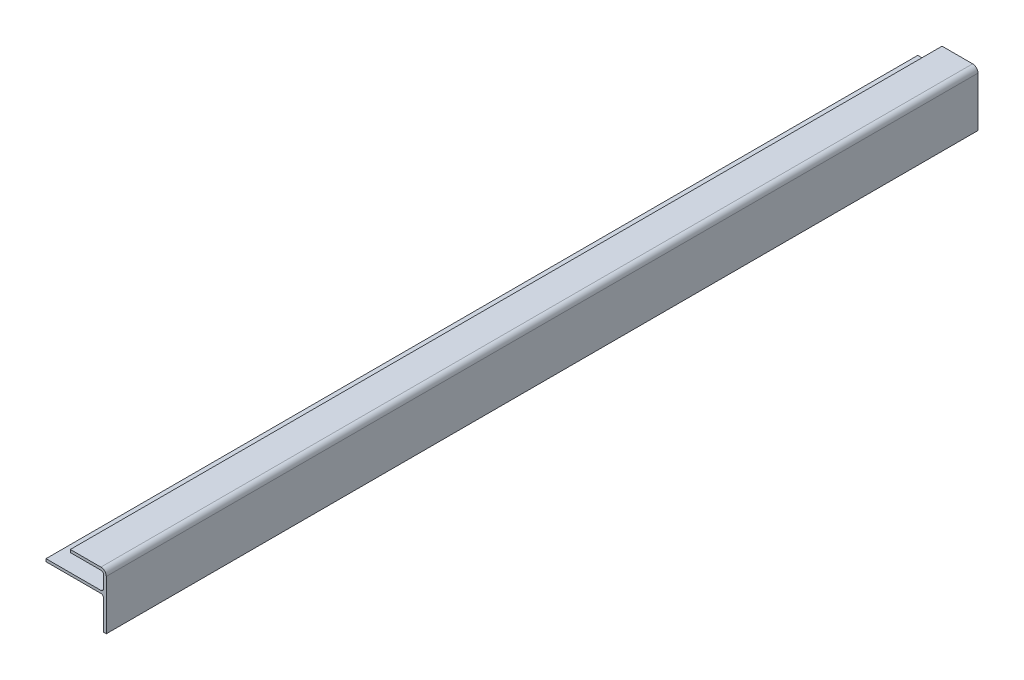
ISO-10303-21;
HEADER;
FILE_DESCRIPTION(('STEP AP214'),'2;1');
FILE_NAME('part.step','',(''),(''),'','','');
FILE_SCHEMA(('AUTOMOTIVE_DESIGN { 1 0 10303 214 1 1 1 1 }'));
ENDSEC;
DATA;
#1=APPLICATION_CONTEXT('core data for automotive mechanical design processes');
#2=APPLICATION_PROTOCOL_DEFINITION('international standard','automotive_design',2000,#1);
#3=PRODUCT_CONTEXT('',#1,'mechanical');
#4=PRODUCT('Part','Part','',(#3));
#5=PRODUCT_RELATED_PRODUCT_CATEGORY('part','',(#4));
#6=PRODUCT_DEFINITION_FORMATION('','',#4);
#7=PRODUCT_DEFINITION_CONTEXT('part definition',#1,'design');
#8=PRODUCT_DEFINITION('design','',#6,#7);
#9=PRODUCT_DEFINITION_SHAPE('','',#8);
#10=(LENGTH_UNIT() NAMED_UNIT(*) SI_UNIT(.MILLI.,.METRE.));
#11=(NAMED_UNIT(*) PLANE_ANGLE_UNIT() SI_UNIT($,.RADIAN.));
#12=(NAMED_UNIT(*) SI_UNIT($,.STERADIAN.) SOLID_ANGLE_UNIT());
#13=UNCERTAINTY_MEASURE_WITH_UNIT(LENGTH_MEASURE(1.E-05),#10,'distance_accuracy_value','');
#14=(GEOMETRIC_REPRESENTATION_CONTEXT(3) GLOBAL_UNCERTAINTY_ASSIGNED_CONTEXT((#13)) GLOBAL_UNIT_ASSIGNED_CONTEXT((#10,
#11,#12)) REPRESENTATION_CONTEXT('',''));
#15=CARTESIAN_POINT('',(0.,0.,0.));
#16=DIRECTION('',(0.,0.,1.));
#17=DIRECTION('',(1.,0.,0.));
#18=AXIS2_PLACEMENT_3D('',#15,#16,#17);
#19=CARTESIAN_POINT('',(1217.6125,36.5125,257.175));
#20=DIRECTION('',(0.,0.,-1.));
#21=DIRECTION('',(-1.,0.,0.));
#22=AXIS2_PLACEMENT_3D('',#19,#20,#21);
#23=CYLINDRICAL_SURFACE('',#22,1.58749999999993);
#24=CARTESIAN_POINT('',(1217.6125,36.5125,-257.175));
#25=DIRECTION('',(0.,0.,-1.));
#26=DIRECTION('',(1.,0.,0.));
#27=AXIS2_PLACEMENT_3D('',#24,#25,#26);
#28=CIRCLE('',#27,1.58749999999993);
#29=CARTESIAN_POINT('',(1217.6125,38.1,-257.175));
#30=VERTEX_POINT('',#29);
#31=CARTESIAN_POINT('',(1219.2,36.5125,-257.175));
#32=VERTEX_POINT('',#31);
#33=EDGE_CURVE('E163',#30,#32,#28,.T.);
#34=ORIENTED_EDGE('',*,*,#33,.T.);
#35=DIRECTION('',(0.,0.,-1.));
#36=VECTOR('',#35,1.);
#37=CARTESIAN_POINT('',(1219.2,36.5125,257.175));
#38=LINE('',#37,#36);
#39=CARTESIAN_POINT('',(1219.2,36.5125,257.175));
#40=VERTEX_POINT('',#39);
#41=EDGE_CURVE('E11',#40,#32,#38,.T.);
#42=ORIENTED_EDGE('',*,*,#41,.F.);
#43=CARTESIAN_POINT('',(1217.6125,36.5125,257.175));
#44=DIRECTION('',(0.,0.,-1.));
#45=DIRECTION('',(1.,0.,0.));
#46=AXIS2_PLACEMENT_3D('',#43,#44,#45);
#47=CIRCLE('',#46,1.58749999999993);
#48=CARTESIAN_POINT('',(1217.6125,38.1,257.175));
#49=VERTEX_POINT('',#48);
#50=EDGE_CURVE('E189',#49,#40,#47,.T.);
#51=ORIENTED_EDGE('',*,*,#50,.F.);
#52=DIRECTION('',(0.,0.,-1.));
#53=VECTOR('',#52,1.);
#54=CARTESIAN_POINT('',(1217.6125,38.1,257.175));
#55=LINE('',#54,#53);
#56=EDGE_CURVE('E159',#49,#30,#55,.T.);
#57=ORIENTED_EDGE('',*,*,#56,.T.);
#58=EDGE_LOOP('',(#34,#42,#51,#57));
#59=FACE_BOUND('',#58,.T.);
#60=ADVANCED_FACE('F31',(#59),#23,.F.);
#61=CARTESIAN_POINT('',(1219.2,19.05,257.175));
#62=DIRECTION('',(1.,0.,0.));
#63=DIRECTION('',(0.,0.,-1.));
#64=AXIS2_PLACEMENT_3D('',#61,#62,#63);
#65=PLANE('',#64);
#66=DIRECTION('',(0.,-1.,0.));
#67=VECTOR('',#66,1.);
#68=CARTESIAN_POINT('',(1219.2,19.05,-257.175));
#69=LINE('',#68,#67);
#70=CARTESIAN_POINT('',(1219.2,19.05,-257.175));
#71=VERTEX_POINT('',#70);
#72=EDGE_CURVE('E166',#32,#71,#69,.T.);
#73=ORIENTED_EDGE('',*,*,#72,.T.);
#74=DIRECTION('',(0.,0.,-1.));
#75=VECTOR('',#74,1.);
#76=CARTESIAN_POINT('',(1219.2,19.05,257.175));
#77=LINE('',#76,#75);
#78=CARTESIAN_POINT('',(1219.2,19.05,257.175));
#79=VERTEX_POINT('',#78);
#80=EDGE_CURVE('E39',#79,#71,#77,.T.);
#81=ORIENTED_EDGE('',*,*,#80,.F.);
#82=DIRECTION('',(0.,-1.,0.));
#83=VECTOR('',#82,1.);
#84=CARTESIAN_POINT('',(1219.2,19.05,257.175));
#85=LINE('',#84,#83);
#86=EDGE_CURVE('E108',#40,#79,#85,.T.);
#87=ORIENTED_EDGE('',*,*,#86,.F.);
#88=ORIENTED_EDGE('',*,*,#41,.T.);
#89=EDGE_LOOP('',(#73,#81,#87,#88));
#90=FACE_BOUND('',#89,.T.);
#91=ADVANCED_FACE('F277',(#90),#65,.F.);
#92=CARTESIAN_POINT('',(1219.2,19.05,257.175));
#93=DIRECTION('',(0.,1.,0.));
#94=DIRECTION('',(0.,0.,1.));
#95=AXIS2_PLACEMENT_3D('',#92,#93,#94);
#96=PLANE('',#95);
#97=DIRECTION('',(1.,0.,0.));
#98=VECTOR('',#97,1.);
#99=CARTESIAN_POINT('',(1219.2,19.05,-257.175));
#100=LINE('',#99,#98);
#101=CARTESIAN_POINT('',(1220.7875,19.05,-257.175));
#102=VERTEX_POINT('',#101);
#103=EDGE_CURVE('E168',#71,#102,#100,.T.);
#104=ORIENTED_EDGE('',*,*,#103,.T.);
#105=DIRECTION('',(0.,0.,-1.));
#106=VECTOR('',#105,1.);
#107=CARTESIAN_POINT('',(1220.7875,19.05,257.175));
#108=LINE('',#107,#106);
#109=CARTESIAN_POINT('',(1220.7875,19.05,257.175));
#110=VERTEX_POINT('',#109);
#111=EDGE_CURVE('E214',#110,#102,#108,.T.);
#112=ORIENTED_EDGE('',*,*,#111,.F.);
#113=DIRECTION('',(1.,0.,0.));
#114=VECTOR('',#113,1.);
#115=CARTESIAN_POINT('',(1219.2,19.05,257.175));
#116=LINE('',#115,#114);
#117=EDGE_CURVE('E222',#79,#110,#116,.T.);
#118=ORIENTED_EDGE('',*,*,#117,.F.);
#119=ORIENTED_EDGE('',*,*,#80,.T.);
#120=EDGE_LOOP('',(#104,#112,#118,#119));
#121=FACE_BOUND('',#120,.T.);
#122=ADVANCED_FACE('F220',(#121),#96,.F.);
#123=CARTESIAN_POINT('',(1220.7875,48.387,257.175));
#124=DIRECTION('',(-1.,0.,0.));
#125=DIRECTION('',(0.,0.,1.));
#126=AXIS2_PLACEMENT_3D('',#123,#124,#125);
#127=PLANE('',#126);
#128=DIRECTION('',(0.,1.,0.));
#129=VECTOR('',#128,1.);
#130=CARTESIAN_POINT('',(1220.7875,48.387,-257.175));
#131=LINE('',#130,#129);
#132=CARTESIAN_POINT('',(1220.7875,48.387,-257.175));
#133=VERTEX_POINT('',#132);
#134=EDGE_CURVE('E170',#102,#133,#131,.T.);
#135=ORIENTED_EDGE('',*,*,#134,.T.);
#136=DIRECTION('',(0.,0.,-1.));
#137=VECTOR('',#136,1.);
#138=CARTESIAN_POINT('',(1220.7875,48.387,257.175));
#139=LINE('',#138,#137);
#140=CARTESIAN_POINT('',(1220.7875,48.387,257.175));
#141=VERTEX_POINT('',#140);
#142=EDGE_CURVE('E211',#141,#133,#139,.T.);
#143=ORIENTED_EDGE('',*,*,#142,.F.);
#144=DIRECTION('',(0.,1.,0.));
#145=VECTOR('',#144,1.);
#146=CARTESIAN_POINT('',(1220.7875,48.387,257.175));
#147=LINE('',#146,#145);
#148=EDGE_CURVE('E240',#110,#141,#147,.T.);
#149=ORIENTED_EDGE('',*,*,#148,.F.);
#150=ORIENTED_EDGE('',*,*,#111,.T.);
#151=EDGE_LOOP('',(#135,#143,#149,#150));
#152=FACE_BOUND('',#151,.T.);
#153=ADVANCED_FACE('F231',(#152),#127,.F.);
#154=CARTESIAN_POINT('',(1217.6125,48.387,257.175));
#155=DIRECTION('',(0.,0.,-1.));
#156=DIRECTION('',(-1.,0.,0.));
#157=AXIS2_PLACEMENT_3D('',#154,#155,#156);
#158=CYLINDRICAL_SURFACE('',#157,3.17499999999997);
#159=CARTESIAN_POINT('',(1217.6125,48.387,-257.175));
#160=DIRECTION('',(0.,0.,1.));
#161=DIRECTION('',(1.,0.,0.));
#162=AXIS2_PLACEMENT_3D('',#159,#160,#161);
#163=CIRCLE('',#162,3.17499999999997);
#164=CARTESIAN_POINT('',(1217.6125,51.562,-257.175));
#165=VERTEX_POINT('',#164);
#166=EDGE_CURVE('E172',#133,#165,#163,.T.);
#167=ORIENTED_EDGE('',*,*,#166,.T.);
#168=DIRECTION('',(0.,0.,-1.));
#169=VECTOR('',#168,1.);
#170=CARTESIAN_POINT('',(1217.6125,51.562,257.175));
#171=LINE('',#170,#169);
#172=CARTESIAN_POINT('',(1217.6125,51.562,257.175));
#173=VERTEX_POINT('',#172);
#174=EDGE_CURVE('E208',#173,#165,#171,.T.);
#175=ORIENTED_EDGE('',*,*,#174,.F.);
#176=CARTESIAN_POINT('',(1217.6125,48.387,257.175));
#177=DIRECTION('',(0.,0.,1.));
#178=DIRECTION('',(1.,0.,0.));
#179=AXIS2_PLACEMENT_3D('',#176,#177,#178);
#180=CIRCLE('',#179,3.17499999999997);
#181=EDGE_CURVE('E237',#141,#173,#180,.T.);
#182=ORIENTED_EDGE('',*,*,#181,.F.);
#183=ORIENTED_EDGE('',*,*,#142,.T.);
#184=EDGE_LOOP('',(#167,#175,#182,#183));
#185=FACE_BOUND('',#184,.T.);
#186=ADVANCED_FACE('F235',(#185),#158,.T.);
#187=CARTESIAN_POINT('',(1217.6125,51.562,257.175));
#188=DIRECTION('',(0.,-1.,0.));
#189=DIRECTION('',(1.,0.,0.));
#190=AXIS2_PLACEMENT_3D('',#187,#188,#189);
#191=PLANE('',#190);
#192=DIRECTION('',(-1.,0.,0.));
#193=VECTOR('',#192,1.);
#194=CARTESIAN_POINT('',(1217.6125,51.562,-257.175));
#195=LINE('',#194,#193);
#196=CARTESIAN_POINT('',(1199.5785,51.562,-257.175));
#197=VERTEX_POINT('',#196);
#198=EDGE_CURVE('E174',#165,#197,#195,.T.);
#199=ORIENTED_EDGE('',*,*,#198,.T.);
#200=DIRECTION('',(0.,0.,-1.));
#201=VECTOR('',#200,1.);
#202=CARTESIAN_POINT('',(1199.5785,51.562,257.175));
#203=LINE('',#202,#201);
#204=CARTESIAN_POINT('',(1199.5785,51.562,257.175));
#205=VERTEX_POINT('',#204);
#206=EDGE_CURVE('E205',#205,#197,#203,.T.);
#207=ORIENTED_EDGE('',*,*,#206,.F.);
#208=DIRECTION('',(-1.,0.,0.));
#209=VECTOR('',#208,1.);
#210=CARTESIAN_POINT('',(1217.6125,51.562,257.175));
#211=LINE('',#210,#209);
#212=EDGE_CURVE('E239',#173,#205,#211,.T.);
#213=ORIENTED_EDGE('',*,*,#212,.F.);
#214=ORIENTED_EDGE('',*,*,#174,.T.);
#215=EDGE_LOOP('',(#199,#207,#213,#214));
#216=FACE_BOUND('',#215,.T.);
#217=ADVANCED_FACE('F290',(#216),#191,.F.);
#218=CARTESIAN_POINT('',(1199.5785,51.562,257.175));
#219=DIRECTION('',(1.,0.,0.));
#220=DIRECTION('',(0.,0.,-1.));
#221=AXIS2_PLACEMENT_3D('',#218,#219,#220);
#222=PLANE('',#221);
#223=DIRECTION('',(0.,-1.,0.));
#224=VECTOR('',#223,1.);
#225=CARTESIAN_POINT('',(1199.5785,51.562,-257.175));
#226=LINE('',#225,#224);
#227=CARTESIAN_POINT('',(1199.5785,49.9745,-257.175));
#228=VERTEX_POINT('',#227);
#229=EDGE_CURVE('E176',#197,#228,#226,.T.);
#230=ORIENTED_EDGE('',*,*,#229,.T.);
#231=DIRECTION('',(0.,0.,-1.));
#232=VECTOR('',#231,1.);
#233=CARTESIAN_POINT('',(1199.5785,49.9745,257.175));
#234=LINE('',#233,#232);
#235=CARTESIAN_POINT('',(1199.5785,49.9745,257.175));
#236=VERTEX_POINT('',#235);
#237=EDGE_CURVE('E202',#236,#228,#234,.T.);
#238=ORIENTED_EDGE('',*,*,#237,.F.);
#239=DIRECTION('',(0.,-1.,0.));
#240=VECTOR('',#239,1.);
#241=CARTESIAN_POINT('',(1199.5785,51.562,257.175));
#242=LINE('',#241,#240);
#243=EDGE_CURVE('E242',#205,#236,#242,.T.);
#244=ORIENTED_EDGE('',*,*,#243,.F.);
#245=ORIENTED_EDGE('',*,*,#206,.T.);
#246=EDGE_LOOP('',(#230,#238,#244,#245));
#247=FACE_BOUND('',#246,.T.);
#248=ADVANCED_FACE('F293',(#247),#222,.F.);
#249=CARTESIAN_POINT('',(1199.5785,49.9745,257.175));
#250=DIRECTION('',(0.,1.,0.));
#251=DIRECTION('',(0.,0.,1.));
#252=AXIS2_PLACEMENT_3D('',#249,#250,#251);
#253=PLANE('',#252);
#254=DIRECTION('',(1.,0.,0.));
#255=VECTOR('',#254,1.);
#256=CARTESIAN_POINT('',(1199.5785,49.9745,-257.175));
#257=LINE('',#256,#255);
#258=CARTESIAN_POINT('',(1217.6125,49.9745,-257.175));
#259=VERTEX_POINT('',#258);
#260=EDGE_CURVE('E178',#228,#259,#257,.T.);
#261=ORIENTED_EDGE('',*,*,#260,.T.);
#262=DIRECTION('',(0.,0.,-1.));
#263=VECTOR('',#262,1.);
#264=CARTESIAN_POINT('',(1217.6125,49.9745,257.175));
#265=LINE('',#264,#263);
#266=CARTESIAN_POINT('',(1217.6125,49.9745,257.175));
#267=VERTEX_POINT('',#266);
#268=EDGE_CURVE('E199',#267,#259,#265,.T.);
#269=ORIENTED_EDGE('',*,*,#268,.F.);
#270=DIRECTION('',(1.,0.,0.));
#271=VECTOR('',#270,1.);
#272=CARTESIAN_POINT('',(1199.5785,49.9745,257.175));
#273=LINE('',#272,#271);
#274=EDGE_CURVE('E248',#236,#267,#273,.T.);
#275=ORIENTED_EDGE('',*,*,#274,.F.);
#276=ORIENTED_EDGE('',*,*,#237,.T.);
#277=EDGE_LOOP('',(#261,#269,#275,#276));
#278=FACE_BOUND('',#277,.T.);
#279=ADVANCED_FACE('F297',(#278),#253,.F.);
#280=CARTESIAN_POINT('',(1217.6125,48.387,257.175));
#281=DIRECTION('',(0.,0.,-1.));
#282=DIRECTION('',(-1.,0.,0.));
#283=AXIS2_PLACEMENT_3D('',#280,#281,#282);
#284=CYLINDRICAL_SURFACE('',#283,1.58749999999993);
#285=CARTESIAN_POINT('',(1217.6125,48.387,-257.175));
#286=DIRECTION('',(0.,0.,-1.));
#287=DIRECTION('',(1.,0.,0.));
#288=AXIS2_PLACEMENT_3D('',#285,#286,#287);
#289=CIRCLE('',#288,1.58749999999993);
#290=CARTESIAN_POINT('',(1219.2,48.387,-257.175));
#291=VERTEX_POINT('',#290);
#292=EDGE_CURVE('E180',#259,#291,#289,.T.);
#293=ORIENTED_EDGE('',*,*,#292,.T.);
#294=DIRECTION('',(0.,0.,-1.));
#295=VECTOR('',#294,1.);
#296=CARTESIAN_POINT('',(1219.2,48.387,257.175));
#297=LINE('',#296,#295);
#298=CARTESIAN_POINT('',(1219.2,48.387,257.175));
#299=VERTEX_POINT('',#298);
#300=EDGE_CURVE('E196',#299,#291,#297,.T.);
#301=ORIENTED_EDGE('',*,*,#300,.F.);
#302=CARTESIAN_POINT('',(1217.6125,48.387,257.175));
#303=DIRECTION('',(0.,0.,-1.));
#304=DIRECTION('',(1.,0.,0.));
#305=AXIS2_PLACEMENT_3D('',#302,#303,#304);
#306=CIRCLE('',#305,1.58749999999993);
#307=EDGE_CURVE('E250',#267,#299,#306,.T.);
#308=ORIENTED_EDGE('',*,*,#307,.F.);
#309=ORIENTED_EDGE('',*,*,#268,.T.);
#310=EDGE_LOOP('',(#293,#301,#308,#309));
#311=FACE_BOUND('',#310,.T.);
#312=ADVANCED_FACE('F301',(#311),#284,.F.);
#313=CARTESIAN_POINT('',(1219.2,48.387,257.175));
#314=DIRECTION('',(1.,0.,0.));
#315=DIRECTION('',(0.,0.,-1.));
#316=AXIS2_PLACEMENT_3D('',#313,#314,#315);
#317=PLANE('',#316);
#318=DIRECTION('',(0.,-1.,0.));
#319=VECTOR('',#318,1.);
#320=CARTESIAN_POINT('',(1219.2,48.387,-257.175));
#321=LINE('',#320,#319);
#322=CARTESIAN_POINT('',(1219.2,41.275,-257.175));
#323=VERTEX_POINT('',#322);
#324=EDGE_CURVE('E182',#291,#323,#321,.T.);
#325=ORIENTED_EDGE('',*,*,#324,.T.);
#326=DIRECTION('',(0.,0.,-1.));
#327=VECTOR('',#326,1.);
#328=CARTESIAN_POINT('',(1219.2,41.275,257.175));
#329=LINE('',#328,#327);
#330=CARTESIAN_POINT('',(1219.2,41.275,257.175));
#331=VERTEX_POINT('',#330);
#332=EDGE_CURVE('E193',#331,#323,#329,.T.);
#333=ORIENTED_EDGE('',*,*,#332,.F.);
#334=DIRECTION('',(0.,-1.,0.));
#335=VECTOR('',#334,1.);
#336=CARTESIAN_POINT('',(1219.2,48.387,257.175));
#337=LINE('',#336,#335);
#338=EDGE_CURVE('E252',#299,#331,#337,.T.);
#339=ORIENTED_EDGE('',*,*,#338,.F.);
#340=ORIENTED_EDGE('',*,*,#300,.T.);
#341=EDGE_LOOP('',(#325,#333,#339,#340));
#342=FACE_BOUND('',#341,.T.);
#343=ADVANCED_FACE('F258',(#342),#317,.F.);
#344=CARTESIAN_POINT('',(1217.6125,41.275,257.175));
#345=DIRECTION('',(0.,0.,-1.));
#346=DIRECTION('',(-1.,0.,0.));
#347=AXIS2_PLACEMENT_3D('',#344,#345,#346);
#348=CYLINDRICAL_SURFACE('',#347,1.58749999999993);
#349=CARTESIAN_POINT('',(1217.6125,41.275,-257.175));
#350=DIRECTION('',(0.,0.,-1.));
#351=DIRECTION('',(1.,0.,0.));
#352=AXIS2_PLACEMENT_3D('',#349,#350,#351);
#353=CIRCLE('',#352,1.58749999999993);
#354=CARTESIAN_POINT('',(1217.6125,39.6875000000001,-257.175));
#355=VERTEX_POINT('',#354);
#356=EDGE_CURVE('E184',#323,#355,#353,.T.);
#357=ORIENTED_EDGE('',*,*,#356,.T.);
#358=DIRECTION('',(0.,0.,-1.));
#359=VECTOR('',#358,1.);
#360=CARTESIAN_POINT('',(1217.6125,39.6875000000001,257.175));
#361=LINE('',#360,#359);
#362=CARTESIAN_POINT('',(1217.6125,39.6875000000001,257.175));
#363=VERTEX_POINT('',#362);
#364=EDGE_CURVE('E154',#363,#355,#361,.T.);
#365=ORIENTED_EDGE('',*,*,#364,.F.);
#366=CARTESIAN_POINT('',(1217.6125,41.275,257.175));
#367=DIRECTION('',(0.,0.,-1.));
#368=DIRECTION('',(1.,0.,0.));
#369=AXIS2_PLACEMENT_3D('',#366,#367,#368);
#370=CIRCLE('',#369,1.58749999999993);
#371=EDGE_CURVE('E145',#331,#363,#370,.T.);
#372=ORIENTED_EDGE('',*,*,#371,.F.);
#373=ORIENTED_EDGE('',*,*,#332,.T.);
#374=EDGE_LOOP('',(#357,#365,#372,#373));
#375=FACE_BOUND('',#374,.T.);
#376=ADVANCED_FACE('F262',(#375),#348,.F.);
#377=CARTESIAN_POINT('',(1185.2275,39.6875,257.175));
#378=DIRECTION('',(0.,-1.,0.));
#379=DIRECTION('',(0.,0.,-1.));
#380=AXIS2_PLACEMENT_3D('',#377,#378,#379);
#381=PLANE('',#380);
#382=DIRECTION('',(-1.,0.,0.));
#383=VECTOR('',#382,1.);
#384=CARTESIAN_POINT('',(1185.2275,39.6875,-257.175));
#385=LINE('',#384,#383);
#386=CARTESIAN_POINT('',(1185.2275,39.6875,-257.175));
#387=VERTEX_POINT('',#386);
#388=EDGE_CURVE('E153',#355,#387,#385,.T.);
#389=ORIENTED_EDGE('',*,*,#388,.T.);
#390=DIRECTION('',(0.,0.,-1.));
#391=VECTOR('',#390,1.);
#392=CARTESIAN_POINT('',(1185.2275,39.6875,257.175));
#393=LINE('',#392,#391);
#394=CARTESIAN_POINT('',(1185.2275,39.6875,257.175));
#395=VERTEX_POINT('',#394);
#396=EDGE_CURVE('E150',#395,#387,#393,.T.);
#397=ORIENTED_EDGE('',*,*,#396,.F.);
#398=DIRECTION('',(-1.,0.,0.));
#399=VECTOR('',#398,1.);
#400=CARTESIAN_POINT('',(1185.2275,39.6875,257.175));
#401=LINE('',#400,#399);
#402=EDGE_CURVE('E139',#363,#395,#401,.T.);
#403=ORIENTED_EDGE('',*,*,#402,.F.);
#404=ORIENTED_EDGE('',*,*,#364,.T.);
#405=EDGE_LOOP('',(#389,#397,#403,#404));
#406=FACE_BOUND('',#405,.T.);
#407=ADVANCED_FACE('F151',(#406),#381,.F.);
#408=CARTESIAN_POINT('',(1185.2275,38.1,257.175));
#409=DIRECTION('',(1.,0.,0.));
#410=DIRECTION('',(0.,0.,-1.));
#411=AXIS2_PLACEMENT_3D('',#408,#409,#410);
#412=PLANE('',#411);
#413=DIRECTION('',(0.,-1.,0.));
#414=VECTOR('',#413,1.);
#415=CARTESIAN_POINT('',(1185.2275,38.1,-257.175));
#416=LINE('',#415,#414);
#417=CARTESIAN_POINT('',(1185.2275,38.1,-257.175));
#418=VERTEX_POINT('',#417);
#419=EDGE_CURVE('E94',#387,#418,#416,.T.);
#420=ORIENTED_EDGE('',*,*,#419,.T.);
#421=DIRECTION('',(0.,0.,-1.));
#422=VECTOR('',#421,1.);
#423=CARTESIAN_POINT('',(1185.2275,38.1,257.175));
#424=LINE('',#423,#422);
#425=CARTESIAN_POINT('',(1185.2275,38.1,257.175));
#426=VERTEX_POINT('',#425);
#427=EDGE_CURVE('E155',#426,#418,#424,.T.);
#428=ORIENTED_EDGE('',*,*,#427,.F.);
#429=DIRECTION('',(0.,-1.,0.));
#430=VECTOR('',#429,1.);
#431=CARTESIAN_POINT('',(1185.2275,38.1,257.175));
#432=LINE('',#431,#430);
#433=EDGE_CURVE('E143',#395,#426,#432,.T.);
#434=ORIENTED_EDGE('',*,*,#433,.F.);
#435=ORIENTED_EDGE('',*,*,#396,.T.);
#436=EDGE_LOOP('',(#420,#428,#434,#435));
#437=FACE_BOUND('',#436,.T.);
#438=ADVANCED_FACE('F157',(#437),#412,.F.);
#439=CARTESIAN_POINT('',(1217.6125,38.1,257.175));
#440=DIRECTION('',(0.,1.,0.));
#441=DIRECTION('',(0.,0.,1.));
#442=AXIS2_PLACEMENT_3D('',#439,#440,#441);
#443=PLANE('',#442);
#444=DIRECTION('',(1.,0.,0.));
#445=VECTOR('',#444,1.);
#446=CARTESIAN_POINT('',(1217.6125,38.1,-257.175));
#447=LINE('',#446,#445);
#448=EDGE_CURVE('E100',#418,#30,#447,.T.);
#449=ORIENTED_EDGE('',*,*,#448,.T.);
#450=ORIENTED_EDGE('',*,*,#56,.F.);
#451=DIRECTION('',(1.,0.,0.));
#452=VECTOR('',#451,1.);
#453=CARTESIAN_POINT('',(1217.6125,38.1,257.175));
#454=LINE('',#453,#452);
#455=EDGE_CURVE('E47',#426,#49,#454,.T.);
#456=ORIENTED_EDGE('',*,*,#455,.F.);
#457=ORIENTED_EDGE('',*,*,#427,.T.);
#458=EDGE_LOOP('',(#449,#450,#456,#457));
#459=FACE_BOUND('',#458,.T.);
#460=ADVANCED_FACE('F266',(#459),#443,.F.);
#461=CARTESIAN_POINT('',(1217.6125,36.5125,257.175));
#462=DIRECTION('',(0.,0.,1.));
#463=DIRECTION('',(1.,0.,0.));
#464=AXIS2_PLACEMENT_3D('',#461,#462,#463);
#465=PLANE('',#464);
#466=ORIENTED_EDGE('',*,*,#50,.T.);
#467=ORIENTED_EDGE('',*,*,#86,.T.);
#468=ORIENTED_EDGE('',*,*,#117,.T.);
#469=ORIENTED_EDGE('',*,*,#148,.T.);
#470=ORIENTED_EDGE('',*,*,#181,.T.);
#471=ORIENTED_EDGE('',*,*,#212,.T.);
#472=ORIENTED_EDGE('',*,*,#243,.T.);
#473=ORIENTED_EDGE('',*,*,#274,.T.);
#474=ORIENTED_EDGE('',*,*,#307,.T.);
#475=ORIENTED_EDGE('',*,*,#338,.T.);
#476=ORIENTED_EDGE('',*,*,#371,.T.);
#477=ORIENTED_EDGE('',*,*,#402,.T.);
#478=ORIENTED_EDGE('',*,*,#433,.T.);
#479=ORIENTED_EDGE('',*,*,#455,.T.);
#480=EDGE_LOOP('',(#466,#467,#468,#469,#470,#471,#472,#473,#474,#475,#476,#477,#478,#479));
#481=FACE_BOUND('',#480,.T.);
#482=ADVANCED_FACE('F141',(#481),#465,.T.);
#483=CARTESIAN_POINT('',(1217.6125,36.5125,-257.175));
#484=DIRECTION('',(0.,0.,1.));
#485=DIRECTION('',(1.,0.,0.));
#486=AXIS2_PLACEMENT_3D('',#483,#484,#485);
#487=PLANE('',#486);
#488=ORIENTED_EDGE('',*,*,#33,.F.);
#489=ORIENTED_EDGE('',*,*,#448,.F.);
#490=ORIENTED_EDGE('',*,*,#419,.F.);
#491=ORIENTED_EDGE('',*,*,#388,.F.);
#492=ORIENTED_EDGE('',*,*,#356,.F.);
#493=ORIENTED_EDGE('',*,*,#324,.F.);
#494=ORIENTED_EDGE('',*,*,#292,.F.);
#495=ORIENTED_EDGE('',*,*,#260,.F.);
#496=ORIENTED_EDGE('',*,*,#229,.F.);
#497=ORIENTED_EDGE('',*,*,#198,.F.);
#498=ORIENTED_EDGE('',*,*,#166,.F.);
#499=ORIENTED_EDGE('',*,*,#134,.F.);
#500=ORIENTED_EDGE('',*,*,#103,.F.);
#501=ORIENTED_EDGE('',*,*,#72,.F.);
#502=EDGE_LOOP('',(#488,#489,#490,#491,#492,#493,#494,#495,#496,#497,#498,#499,#500,#501));
#503=FACE_BOUND('',#502,.T.);
#504=ADVANCED_FACE('F226',(#503),#487,.F.);
#505=CLOSED_SHELL('',(#60,#91,#122,#153,#186,#217,#248,#279,#312,#343,#376,#407,#438,#460,#482,#504));
#506=MANIFOLD_SOLID_BREP('B2',#505);
#507=ADVANCED_BREP_SHAPE_REPRESENTATION('',(#18,#506),#14);
#508=SHAPE_DEFINITION_REPRESENTATION(#9,#507);
ENDSEC;
END-ISO-10303-21;
